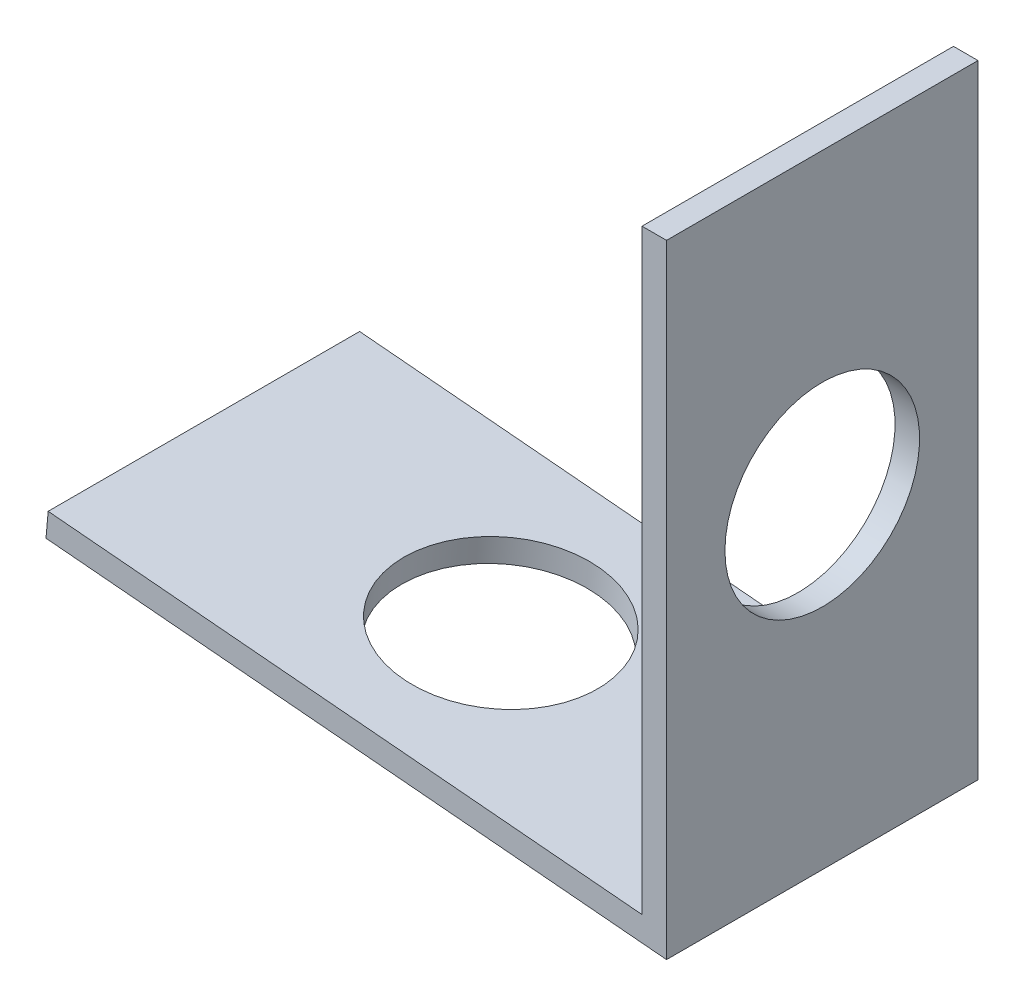
ISO-10303-21;
HEADER;
FILE_DESCRIPTION(('STEP AP214'),'2;1');
FILE_NAME('part.step','',(''),(''),'','','');
FILE_SCHEMA(('AUTOMOTIVE_DESIGN { 1 0 10303 214 1 1 1 1 }'));
ENDSEC;
DATA;
#1=APPLICATION_CONTEXT('core data for automotive mechanical design processes');
#2=APPLICATION_PROTOCOL_DEFINITION('international standard','automotive_design',2000,#1);
#3=PRODUCT_CONTEXT('',#1,'mechanical');
#4=PRODUCT('Part','Part','',(#3));
#5=PRODUCT_RELATED_PRODUCT_CATEGORY('part','',(#4));
#6=PRODUCT_DEFINITION_FORMATION('','',#4);
#7=PRODUCT_DEFINITION_CONTEXT('part definition',#1,'design');
#8=PRODUCT_DEFINITION('design','',#6,#7);
#9=PRODUCT_DEFINITION_SHAPE('','',#8);
#10=(LENGTH_UNIT() NAMED_UNIT(*) SI_UNIT(.MILLI.,.METRE.));
#11=(NAMED_UNIT(*) PLANE_ANGLE_UNIT() SI_UNIT($,.RADIAN.));
#12=(NAMED_UNIT(*) SI_UNIT($,.STERADIAN.) SOLID_ANGLE_UNIT());
#13=UNCERTAINTY_MEASURE_WITH_UNIT(LENGTH_MEASURE(1.E-05),#10,'distance_accuracy_value','');
#14=(GEOMETRIC_REPRESENTATION_CONTEXT(3) GLOBAL_UNCERTAINTY_ASSIGNED_CONTEXT((#13)) GLOBAL_UNIT_ASSIGNED_CONTEXT((#10,
#11,#12)) REPRESENTATION_CONTEXT('',''));
#15=CARTESIAN_POINT('',(0.,0.,0.));
#16=DIRECTION('',(0.,0.,1.));
#17=DIRECTION('',(1.,0.,0.));
#18=AXIS2_PLACEMENT_3D('',#15,#16,#17);
#19=CARTESIAN_POINT('',(0.,0.,6.35));
#20=DIRECTION('',(0.0877609439652255,0.99614156459528,0.));
#21=DIRECTION('',(-0.99614156459528,0.0877609439652255,0.));
#22=AXIS2_PLACEMENT_3D('',#19,#20,#21);
#23=PLANE('',#22);
#24=CARTESIAN_POINT('',(-13.1948783423427,1.16248033410872,0.));
#25=DIRECTION('',(0.0877609439652255,0.99614156459528,0.));
#26=DIRECTION('',(-0.99614156459528,0.0877609439652255,0.));
#27=AXIS2_PLACEMENT_3D('',#24,#25,#26);
#28=CIRCLE('',#27,3.96874999999999);
#29=CARTESIAN_POINT('',(-17.1483151768302,1.51078158047071,0.));
#30=VERTEX_POINT('',#29);
#31=EDGE_CURVE('E186',#30,#30,#28,.T.);
#32=ORIENTED_EDGE('',*,*,#31,.T.);
#33=EDGE_LOOP('',(#32));
#34=FACE_BOUND('',#33,.T.);
#35=DIRECTION('',(0.99614156459528,-0.0877609439652255,0.));
#36=VECTOR('',#35,1.);
#37=CARTESIAN_POINT('',(0.,0.,-6.35));
#38=LINE('',#37,#36);
#39=CARTESIAN_POINT('',(-25.3019957407201,2.22912797671673,-6.35));
#40=VERTEX_POINT('',#39);
#41=CARTESIAN_POINT('',(0.,0.,-6.35));
#42=VERTEX_POINT('',#41);
#43=EDGE_CURVE('E132',#40,#42,#38,.T.);
#44=ORIENTED_EDGE('',*,*,#43,.T.);
#45=DIRECTION('',(0.,0.,-1.));
#46=VECTOR('',#45,1.);
#47=CARTESIAN_POINT('',(0.,0.,6.35));
#48=LINE('',#47,#46);
#49=CARTESIAN_POINT('',(0.,0.,6.35));
#50=VERTEX_POINT('',#49);
#51=EDGE_CURVE('E11',#50,#42,#48,.T.);
#52=ORIENTED_EDGE('',*,*,#51,.F.);
#53=DIRECTION('',(0.99614156459528,-0.0877609439652255,0.));
#54=VECTOR('',#53,1.);
#55=CARTESIAN_POINT('',(0.,0.,6.35));
#56=LINE('',#55,#54);
#57=CARTESIAN_POINT('',(-25.3019957407201,2.22912797671673,6.35));
#58=VERTEX_POINT('',#57);
#59=EDGE_CURVE('E149',#58,#50,#56,.T.);
#60=ORIENTED_EDGE('',*,*,#59,.F.);
#61=DIRECTION('',(0.,0.,-1.));
#62=VECTOR('',#61,1.);
#63=CARTESIAN_POINT('',(-25.3019957407201,2.22912797671673,6.35));
#64=LINE('',#63,#62);
#65=EDGE_CURVE('E128',#58,#40,#64,.T.);
#66=ORIENTED_EDGE('',*,*,#65,.T.);
#67=EDGE_LOOP('',(#44,#52,#60,#66));
#68=FACE_BOUND('',#67,.T.);
#69=ADVANCED_FACE('F43',(#34,#68),#23,.F.);
#70=CARTESIAN_POINT('',(0.,0.,6.35));
#71=DIRECTION('',(-1.,0.,0.));
#72=DIRECTION('',(0.,-1.,0.));
#73=AXIS2_PLACEMENT_3D('',#70,#71,#72);
#74=PLANE('',#73);
#75=CARTESIAN_POINT('',(0.,13.245987128048,0.));
#76=DIRECTION('',(-1.,0.,0.));
#77=DIRECTION('',(0.,0.,1.));
#78=AXIS2_PLACEMENT_3D('',#75,#76,#77);
#79=CIRCLE('',#78,3.96875);
#80=CARTESIAN_POINT('',(0.,13.245987128048,3.96875));
#81=VERTEX_POINT('',#80);
#82=EDGE_CURVE('E137',#81,#81,#79,.T.);
#83=ORIENTED_EDGE('',*,*,#82,.T.);
#84=EDGE_LOOP('',(#83));
#85=FACE_BOUND('',#84,.T.);
#86=DIRECTION('',(0.,1.,0.));
#87=VECTOR('',#86,1.);
#88=CARTESIAN_POINT('',(0.,0.,-6.35));
#89=LINE('',#88,#87);
#90=CARTESIAN_POINT('',(0.,25.4,-6.35));
#91=VERTEX_POINT('',#90);
#92=EDGE_CURVE('E136',#42,#91,#89,.T.);
#93=ORIENTED_EDGE('',*,*,#92,.T.);
#94=DIRECTION('',(0.,0.,-1.));
#95=VECTOR('',#94,1.);
#96=CARTESIAN_POINT('',(0.,25.4,6.35));
#97=LINE('',#96,#95);
#98=CARTESIAN_POINT('',(0.,25.4,6.35));
#99=VERTEX_POINT('',#98);
#100=EDGE_CURVE('E52',#99,#91,#97,.T.);
#101=ORIENTED_EDGE('',*,*,#100,.F.);
#102=DIRECTION('',(0.,1.,0.));
#103=VECTOR('',#102,1.);
#104=CARTESIAN_POINT('',(0.,0.,6.35));
#105=LINE('',#104,#103);
#106=EDGE_CURVE('E97',#50,#99,#105,.T.);
#107=ORIENTED_EDGE('',*,*,#106,.F.);
#108=ORIENTED_EDGE('',*,*,#51,.T.);
#109=EDGE_LOOP('',(#93,#101,#107,#108));
#110=FACE_BOUND('',#109,.T.);
#111=ADVANCED_FACE('F178',(#85,#110),#74,.F.);
#112=CARTESIAN_POINT('',(-1.,25.4,6.35));
#113=DIRECTION('',(0.,-1.,0.));
#114=DIRECTION('',(0.,0.,-1.));
#115=AXIS2_PLACEMENT_3D('',#112,#113,#114);
#116=PLANE('',#115);
#117=DIRECTION('',(-1.,0.,0.));
#118=VECTOR('',#117,1.);
#119=CARTESIAN_POINT('',(-1.,25.4,-6.35));
#120=LINE('',#119,#118);
#121=CARTESIAN_POINT('',(-1.,25.4,-6.35));
#122=VERTEX_POINT('',#121);
#123=EDGE_CURVE('E140',#91,#122,#120,.T.);
#124=ORIENTED_EDGE('',*,*,#123,.T.);
#125=DIRECTION('',(0.,0.,-1.));
#126=VECTOR('',#125,1.);
#127=CARTESIAN_POINT('',(-1.,25.4,6.35));
#128=LINE('',#127,#126);
#129=CARTESIAN_POINT('',(-1.,25.4,6.35));
#130=VERTEX_POINT('',#129);
#131=EDGE_CURVE('E121',#130,#122,#128,.T.);
#132=ORIENTED_EDGE('',*,*,#131,.F.);
#133=DIRECTION('',(-1.,0.,0.));
#134=VECTOR('',#133,1.);
#135=CARTESIAN_POINT('',(-1.,25.4,6.35));
#136=LINE('',#135,#134);
#137=EDGE_CURVE('E110',#99,#130,#136,.T.);
#138=ORIENTED_EDGE('',*,*,#137,.F.);
#139=ORIENTED_EDGE('',*,*,#100,.T.);
#140=EDGE_LOOP('',(#124,#132,#138,#139));
#141=FACE_BOUND('',#140,.T.);
#142=ADVANCED_FACE('F159',(#141),#116,.F.);
#143=CARTESIAN_POINT('',(-1.,1.09197425609599,6.35));
#144=DIRECTION('',(1.,0.,0.));
#145=DIRECTION('',(0.,1.,0.));
#146=AXIS2_PLACEMENT_3D('',#143,#144,#145);
#147=PLANE('',#146);
#148=CARTESIAN_POINT('',(-1.,13.245987128048,0.));
#149=DIRECTION('',(-1.,0.,0.));
#150=DIRECTION('',(0.,0.,1.));
#151=AXIS2_PLACEMENT_3D('',#148,#149,#150);
#152=CIRCLE('',#151,3.96874999999999);
#153=CARTESIAN_POINT('',(-1.,13.245987128048,3.96874999999999));
#154=VERTEX_POINT('',#153);
#155=EDGE_CURVE('E189',#154,#154,#152,.T.);
#156=ORIENTED_EDGE('',*,*,#155,.F.);
#157=EDGE_LOOP('',(#156));
#158=FACE_BOUND('',#157,.T.);
#159=DIRECTION('',(0.,-1.,0.));
#160=VECTOR('',#159,1.);
#161=CARTESIAN_POINT('',(-1.,1.09197425609599,-6.35));
#162=LINE('',#161,#160);
#163=CARTESIAN_POINT('',(-1.,1.09197425609599,-6.35));
#164=VERTEX_POINT('',#163);
#165=EDGE_CURVE('E119',#122,#164,#162,.T.);
#166=ORIENTED_EDGE('',*,*,#165,.T.);
#167=DIRECTION('',(0.,0.,-1.));
#168=VECTOR('',#167,1.);
#169=CARTESIAN_POINT('',(-1.,1.09197425609599,6.35));
#170=LINE('',#169,#168);
#171=CARTESIAN_POINT('',(-1.,1.09197425609599,6.35));
#172=VERTEX_POINT('',#171);
#173=EDGE_CURVE('E116',#172,#164,#170,.T.);
#174=ORIENTED_EDGE('',*,*,#173,.F.);
#175=DIRECTION('',(0.,-1.,0.));
#176=VECTOR('',#175,1.);
#177=CARTESIAN_POINT('',(-1.,1.09197425609599,6.35));
#178=LINE('',#177,#176);
#179=EDGE_CURVE('E104',#130,#172,#178,.T.);
#180=ORIENTED_EDGE('',*,*,#179,.F.);
#181=ORIENTED_EDGE('',*,*,#131,.T.);
#182=EDGE_LOOP('',(#166,#174,#180,#181));
#183=FACE_BOUND('',#182,.T.);
#184=ADVANCED_FACE('F117',(#158,#183),#147,.F.);
#185=CARTESIAN_POINT('',(-1.,1.09197425609599,6.35));
#186=DIRECTION('',(-0.0877609439652255,-0.99614156459528,0.));
#187=DIRECTION('',(0.99614156459528,-0.0877609439652255,0.));
#188=AXIS2_PLACEMENT_3D('',#185,#186,#187);
#189=PLANE('',#188);
#190=CARTESIAN_POINT('',(-13.1071173983774,2.158621898704,0.));
#191=DIRECTION('',(0.0877609439652255,0.99614156459528,0.));
#192=DIRECTION('',(-0.99614156459528,0.0877609439652255,0.));
#193=AXIS2_PLACEMENT_3D('',#190,#191,#192);
#194=CIRCLE('',#193,3.96874999999999);
#195=CARTESIAN_POINT('',(-17.0605542328649,2.50692314506599,0.));
#196=VERTEX_POINT('',#195);
#197=EDGE_CURVE('E190',#196,#196,#194,.T.);
#198=ORIENTED_EDGE('',*,*,#197,.F.);
#199=EDGE_LOOP('',(#198));
#200=FACE_BOUND('',#199,.T.);
#201=DIRECTION('',(-0.99614156459528,0.0877609439652255,0.));
#202=VECTOR('',#201,1.);
#203=CARTESIAN_POINT('',(-1.,1.09197425609599,-6.35));
#204=LINE('',#203,#202);
#205=CARTESIAN_POINT('',(-25.2142347967549,3.22526954131201,-6.35));
#206=VERTEX_POINT('',#205);
#207=EDGE_CURVE('E83',#164,#206,#204,.T.);
#208=ORIENTED_EDGE('',*,*,#207,.T.);
#209=DIRECTION('',(0.,0.,-1.));
#210=VECTOR('',#209,1.);
#211=CARTESIAN_POINT('',(-25.2142347967549,3.22526954131201,6.35));
#212=LINE('',#211,#210);
#213=CARTESIAN_POINT('',(-25.2142347967549,3.22526954131201,6.35));
#214=VERTEX_POINT('',#213);
#215=EDGE_CURVE('E122',#214,#206,#212,.T.);
#216=ORIENTED_EDGE('',*,*,#215,.F.);
#217=DIRECTION('',(-0.99614156459528,0.0877609439652255,0.));
#218=VECTOR('',#217,1.);
#219=CARTESIAN_POINT('',(-1.,1.09197425609599,6.35));
#220=LINE('',#219,#218);
#221=EDGE_CURVE('E108',#172,#214,#220,.T.);
#222=ORIENTED_EDGE('',*,*,#221,.F.);
#223=ORIENTED_EDGE('',*,*,#173,.T.);
#224=EDGE_LOOP('',(#208,#216,#222,#223));
#225=FACE_BOUND('',#224,.T.);
#226=ADVANCED_FACE('F124',(#200,#225),#189,.F.);
#227=CARTESIAN_POINT('',(-25.2142347967549,3.22526954131201,6.35));
#228=DIRECTION('',(0.99614156459528,-0.0877609439652281,0.));
#229=DIRECTION('',(0.0877609439652281,0.99614156459528,0.));
#230=AXIS2_PLACEMENT_3D('',#227,#228,#229);
#231=PLANE('',#230);
#232=DIRECTION('',(-0.0877609439652281,-0.99614156459528,0.));
#233=VECTOR('',#232,1.);
#234=CARTESIAN_POINT('',(-25.2142347967549,3.22526954131201,-6.35));
#235=LINE('',#234,#233);
#236=EDGE_CURVE('E89',#206,#40,#235,.T.);
#237=ORIENTED_EDGE('',*,*,#236,.T.);
#238=ORIENTED_EDGE('',*,*,#65,.F.);
#239=DIRECTION('',(-0.0877609439652281,-0.99614156459528,0.));
#240=VECTOR('',#239,1.);
#241=CARTESIAN_POINT('',(-25.2142347967549,3.22526954131201,6.35));
#242=LINE('',#241,#240);
#243=EDGE_CURVE('E60',#214,#58,#242,.T.);
#244=ORIENTED_EDGE('',*,*,#243,.F.);
#245=ORIENTED_EDGE('',*,*,#215,.T.);
#246=EDGE_LOOP('',(#237,#238,#244,#245));
#247=FACE_BOUND('',#246,.T.);
#248=ADVANCED_FACE('F166',(#247),#231,.F.);
#249=CARTESIAN_POINT('',(0.,0.,6.35));
#250=DIRECTION('',(0.,0.,1.));
#251=DIRECTION('',(1.,0.,0.));
#252=AXIS2_PLACEMENT_3D('',#249,#250,#251);
#253=PLANE('',#252);
#254=ORIENTED_EDGE('',*,*,#59,.T.);
#255=ORIENTED_EDGE('',*,*,#106,.T.);
#256=ORIENTED_EDGE('',*,*,#137,.T.);
#257=ORIENTED_EDGE('',*,*,#179,.T.);
#258=ORIENTED_EDGE('',*,*,#221,.T.);
#259=ORIENTED_EDGE('',*,*,#243,.T.);
#260=EDGE_LOOP('',(#254,#255,#256,#257,#258,#259));
#261=FACE_BOUND('',#260,.T.);
#262=ADVANCED_FACE('F106',(#261),#253,.T.);
#263=CARTESIAN_POINT('',(0.,0.,-6.35));
#264=DIRECTION('',(0.,0.,1.));
#265=DIRECTION('',(1.,0.,0.));
#266=AXIS2_PLACEMENT_3D('',#263,#264,#265);
#267=PLANE('',#266);
#268=ORIENTED_EDGE('',*,*,#43,.F.);
#269=ORIENTED_EDGE('',*,*,#236,.F.);
#270=ORIENTED_EDGE('',*,*,#207,.F.);
#271=ORIENTED_EDGE('',*,*,#165,.F.);
#272=ORIENTED_EDGE('',*,*,#123,.F.);
#273=ORIENTED_EDGE('',*,*,#92,.F.);
#274=EDGE_LOOP('',(#268,#269,#270,#271,#272,#273));
#275=FACE_BOUND('',#274,.T.);
#276=ADVANCED_FACE('F162',(#275),#267,.F.);
#277=CARTESIAN_POINT('',(-1.,13.245987128048,0.));
#278=DIRECTION('',(-1.,0.,0.));
#279=DIRECTION('',(0.,0.,1.));
#280=AXIS2_PLACEMENT_3D('',#277,#278,#279);
#281=CYLINDRICAL_SURFACE('',#280,3.96874999999999);
#282=ORIENTED_EDGE('',*,*,#82,.F.);
#283=EDGE_LOOP('',(#282));
#284=FACE_BOUND('',#283,.T.);
#285=ORIENTED_EDGE('',*,*,#155,.T.);
#286=EDGE_LOOP('',(#285));
#287=FACE_BOUND('',#286,.T.);
#288=ADVANCED_FACE('F208',(#284,#287),#281,.F.);
#289=CARTESIAN_POINT('',(-13.1071173983774,2.158621898704,0.));
#290=DIRECTION('',(0.0877609439652255,0.99614156459528,0.));
#291=DIRECTION('',(-0.99614156459528,0.0877609439652255,0.));
#292=AXIS2_PLACEMENT_3D('',#289,#290,#291);
#293=CYLINDRICAL_SURFACE('',#292,3.96874999999999);
#294=ORIENTED_EDGE('',*,*,#197,.T.);
#295=EDGE_LOOP('',(#294));
#296=FACE_BOUND('',#295,.T.);
#297=ORIENTED_EDGE('',*,*,#31,.F.);
#298=EDGE_LOOP('',(#297));
#299=FACE_BOUND('',#298,.T.);
#300=ADVANCED_FACE('F211',(#296,#299),#293,.F.);
#301=CLOSED_SHELL('',(#69,#111,#142,#184,#226,#248,#262,#276,#288,#300));
#302=MANIFOLD_SOLID_BREP('B2',#301);
#303=ADVANCED_BREP_SHAPE_REPRESENTATION('',(#18,#302),#14);
#304=SHAPE_DEFINITION_REPRESENTATION(#9,#303);
ENDSEC;
END-ISO-10303-21;
